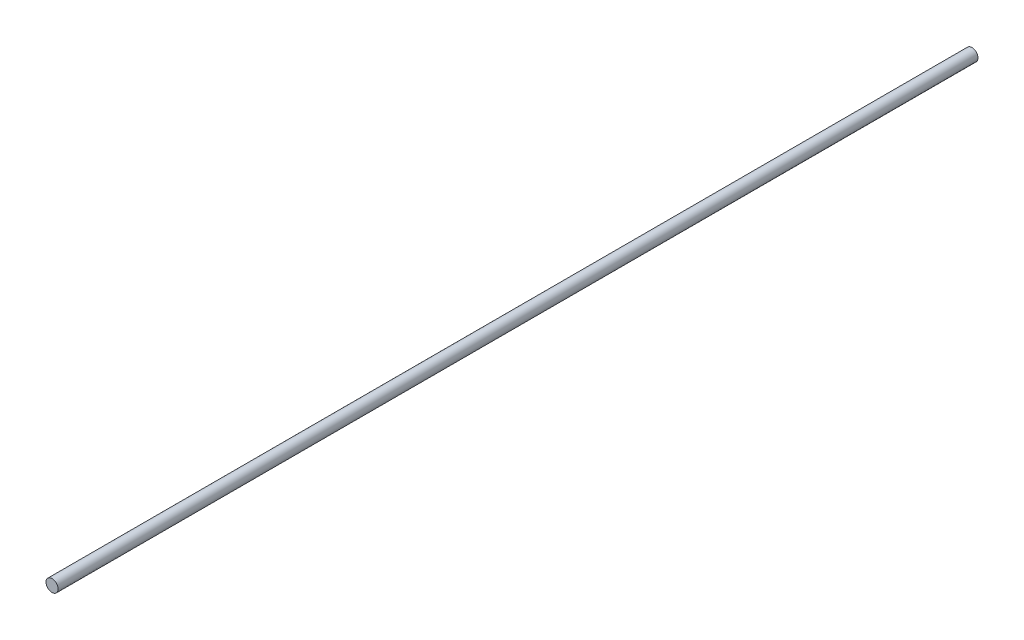
ISO-10303-21;
HEADER;
FILE_DESCRIPTION(('STEP AP214'),'2;1');
FILE_NAME('part.step','',(''),(''),'','','');
FILE_SCHEMA(('AUTOMOTIVE_DESIGN { 1 0 10303 214 1 1 1 1 }'));
ENDSEC;
DATA;
#1=APPLICATION_CONTEXT('core data for automotive mechanical design processes');
#2=APPLICATION_PROTOCOL_DEFINITION('international standard','automotive_design',2000,#1);
#3=PRODUCT_CONTEXT('',#1,'mechanical');
#4=PRODUCT('Part','Part','',(#3));
#5=PRODUCT_RELATED_PRODUCT_CATEGORY('part','',(#4));
#6=PRODUCT_DEFINITION_FORMATION('','',#4);
#7=PRODUCT_DEFINITION_CONTEXT('part definition',#1,'design');
#8=PRODUCT_DEFINITION('design','',#6,#7);
#9=PRODUCT_DEFINITION_SHAPE('','',#8);
#10=(LENGTH_UNIT() NAMED_UNIT(*) SI_UNIT(.MILLI.,.METRE.));
#11=(NAMED_UNIT(*) PLANE_ANGLE_UNIT() SI_UNIT($,.RADIAN.));
#12=(NAMED_UNIT(*) SI_UNIT($,.STERADIAN.) SOLID_ANGLE_UNIT());
#13=UNCERTAINTY_MEASURE_WITH_UNIT(LENGTH_MEASURE(1.E-05),#10,'distance_accuracy_value','');
#14=(GEOMETRIC_REPRESENTATION_CONTEXT(3) GLOBAL_UNCERTAINTY_ASSIGNED_CONTEXT((#13)) GLOBAL_UNIT_ASSIGNED_CONTEXT((#10,
#11,#12)) REPRESENTATION_CONTEXT('',''));
#15=CARTESIAN_POINT('',(0.,0.,0.));
#16=DIRECTION('',(0.,0.,1.));
#17=DIRECTION('',(1.,0.,0.));
#18=AXIS2_PLACEMENT_3D('',#15,#16,#17);
#19=CARTESIAN_POINT('',(0.,0.,482.6));
#20=DIRECTION('',(0.,0.,-1.));
#21=DIRECTION('',(-1.,0.,0.));
#22=AXIS2_PLACEMENT_3D('',#19,#20,#21);
#23=CYLINDRICAL_SURFACE('',#22,3.175);
#24=CARTESIAN_POINT('',(0.,0.,482.6));
#25=DIRECTION('',(0.,0.,1.));
#26=DIRECTION('',(1.,0.,0.));
#27=AXIS2_PLACEMENT_3D('',#24,#25,#26);
#28=CIRCLE('',#27,3.175);
#29=CARTESIAN_POINT('',(3.175,0.,482.6));
#30=VERTEX_POINT('',#29);
#31=EDGE_CURVE('E10',#30,#30,#28,.T.);
#32=ORIENTED_EDGE('',*,*,#31,.F.);
#33=EDGE_LOOP('',(#32));
#34=FACE_BOUND('',#33,.T.);
#35=CARTESIAN_POINT('',(0.,0.,0.));
#36=DIRECTION('',(0.,0.,1.));
#37=DIRECTION('',(1.,0.,0.));
#38=AXIS2_PLACEMENT_3D('',#35,#36,#37);
#39=CIRCLE('',#38,3.175);
#40=CARTESIAN_POINT('',(3.175,0.,0.));
#41=VERTEX_POINT('',#40);
#42=EDGE_CURVE('E38',#41,#41,#39,.T.);
#43=ORIENTED_EDGE('',*,*,#42,.T.);
#44=EDGE_LOOP('',(#43));
#45=FACE_BOUND('',#44,.T.);
#46=ADVANCED_FACE('F35',(#34,#45),#23,.T.);
#47=CARTESIAN_POINT('',(0.,0.,482.6));
#48=DIRECTION('',(0.,0.,1.));
#49=DIRECTION('',(1.,0.,0.));
#50=AXIS2_PLACEMENT_3D('',#47,#48,#49);
#51=PLANE('',#50);
#52=ORIENTED_EDGE('',*,*,#31,.T.);
#53=EDGE_LOOP('',(#52));
#54=FACE_BOUND('',#53,.T.);
#55=ADVANCED_FACE('F50',(#54),#51,.T.);
#56=CARTESIAN_POINT('',(0.,0.,0.));
#57=DIRECTION('',(0.,0.,1.));
#58=DIRECTION('',(1.,0.,0.));
#59=AXIS2_PLACEMENT_3D('',#56,#57,#58);
#60=PLANE('',#59);
#61=ORIENTED_EDGE('',*,*,#42,.F.);
#62=EDGE_LOOP('',(#61));
#63=FACE_BOUND('',#62,.T.);
#64=ADVANCED_FACE('F48',(#63),#60,.F.);
#65=CLOSED_SHELL('',(#46,#55,#64));
#66=MANIFOLD_SOLID_BREP('B2',#65);
#67=ADVANCED_BREP_SHAPE_REPRESENTATION('',(#18,#66),#14);
#68=SHAPE_DEFINITION_REPRESENTATION(#9,#67);
ENDSEC;
END-ISO-10303-21;
